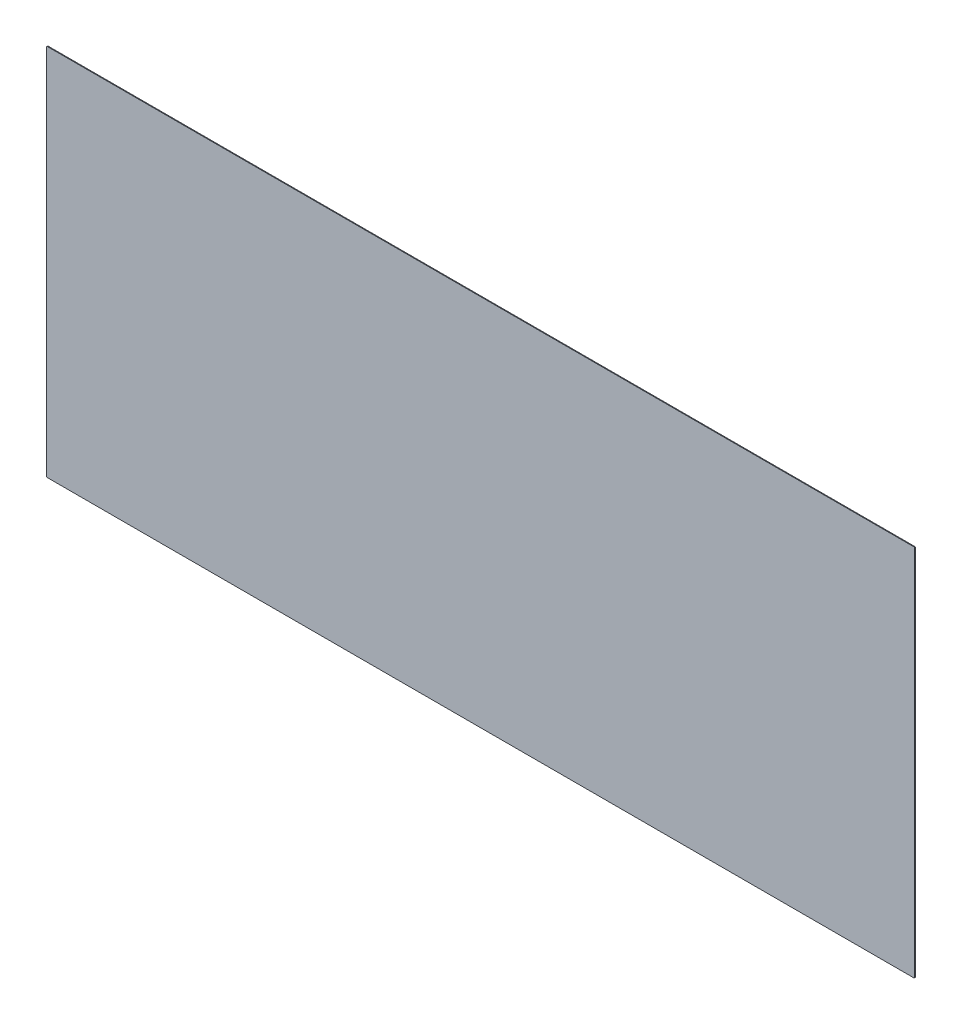
ISO-10303-21;
HEADER;
FILE_DESCRIPTION(('STEP AP214'),'2;1');
FILE_NAME('part.step','',(''),(''),'','','');
FILE_SCHEMA(('AUTOMOTIVE_DESIGN { 1 0 10303 214 1 1 1 1 }'));
ENDSEC;
DATA;
#1=APPLICATION_CONTEXT('core data for automotive mechanical design processes');
#2=APPLICATION_PROTOCOL_DEFINITION('international standard','automotive_design',2000,#1);
#3=PRODUCT_CONTEXT('',#1,'mechanical');
#4=PRODUCT('Part','Part','',(#3));
#5=PRODUCT_RELATED_PRODUCT_CATEGORY('part','',(#4));
#6=PRODUCT_DEFINITION_FORMATION('','',#4);
#7=PRODUCT_DEFINITION_CONTEXT('part definition',#1,'design');
#8=PRODUCT_DEFINITION('design','',#6,#7);
#9=PRODUCT_DEFINITION_SHAPE('','',#8);
#10=(LENGTH_UNIT() NAMED_UNIT(*) SI_UNIT(.MILLI.,.METRE.));
#11=(NAMED_UNIT(*) PLANE_ANGLE_UNIT() SI_UNIT($,.RADIAN.));
#12=(NAMED_UNIT(*) SI_UNIT($,.STERADIAN.) SOLID_ANGLE_UNIT());
#13=UNCERTAINTY_MEASURE_WITH_UNIT(LENGTH_MEASURE(1.E-05),#10,'distance_accuracy_value','');
#14=(GEOMETRIC_REPRESENTATION_CONTEXT(3) GLOBAL_UNCERTAINTY_ASSIGNED_CONTEXT((#13)) GLOBAL_UNIT_ASSIGNED_CONTEXT((#10,
#11,#12)) REPRESENTATION_CONTEXT('',''));
#15=CARTESIAN_POINT('',(0.,0.,0.));
#16=DIRECTION('',(0.,0.,1.));
#17=DIRECTION('',(1.,0.,0.));
#18=AXIS2_PLACEMENT_3D('',#15,#16,#17);
#19=CARTESIAN_POINT('',(1159.,498.,-1.));
#20=DIRECTION('',(0.,0.,1.));
#21=DIRECTION('',(1.,0.,0.));
#22=AXIS2_PLACEMENT_3D('',#19,#20,#21);
#23=CYLINDRICAL_SURFACE('',#22,0.999999999999945);
#24=CARTESIAN_POINT('',(1159.,498.,0.));
#25=DIRECTION('',(0.,0.,1.));
#26=DIRECTION('',(-1.,0.,0.));
#27=AXIS2_PLACEMENT_3D('',#24,#25,#26);
#28=CIRCLE('',#27,0.999999999999945);
#29=CARTESIAN_POINT('',(1160.,498.,0.));
#30=VERTEX_POINT('',#29);
#31=CARTESIAN_POINT('',(1159.,499.,0.));
#32=VERTEX_POINT('',#31);
#33=EDGE_CURVE('E160',#30,#32,#28,.T.);
#34=ORIENTED_EDGE('',*,*,#33,.F.);
#35=DIRECTION('',(0.,0.,1.));
#36=VECTOR('',#35,1.);
#37=CARTESIAN_POINT('',(1160.,498.,-1.));
#38=LINE('',#37,#36);
#39=CARTESIAN_POINT('',(1160.,498.,-1.));
#40=VERTEX_POINT('',#39);
#41=EDGE_CURVE('E12',#40,#30,#38,.T.);
#42=ORIENTED_EDGE('',*,*,#41,.F.);
#43=CARTESIAN_POINT('',(1159.,498.,-1.));
#44=DIRECTION('',(0.,0.,1.));
#45=DIRECTION('',(-1.,0.,0.));
#46=AXIS2_PLACEMENT_3D('',#43,#44,#45);
#47=CIRCLE('',#46,0.999999999999945);
#48=CARTESIAN_POINT('',(1159.,499.,-1.));
#49=VERTEX_POINT('',#48);
#50=EDGE_CURVE('E154',#40,#49,#47,.T.);
#51=ORIENTED_EDGE('',*,*,#50,.T.);
#52=DIRECTION('',(0.,0.,1.));
#53=VECTOR('',#52,1.);
#54=CARTESIAN_POINT('',(1159.,499.,-1.));
#55=LINE('',#54,#53);
#56=EDGE_CURVE('E44',#49,#32,#55,.T.);
#57=ORIENTED_EDGE('',*,*,#56,.T.);
#58=EDGE_LOOP('',(#34,#42,#51,#57));
#59=FACE_BOUND('',#58,.T.);
#60=ADVANCED_FACE('F41',(#59),#23,.T.);
#61=CARTESIAN_POINT('',(1160.,1.00000000000001,-1.));
#62=DIRECTION('',(1.,0.,0.));
#63=DIRECTION('',(0.,0.,-1.));
#64=AXIS2_PLACEMENT_3D('',#61,#62,#63);
#65=PLANE('',#64);
#66=DIRECTION('',(0.,1.,0.));
#67=VECTOR('',#66,1.);
#68=CARTESIAN_POINT('',(1160.,1.00000000000001,0.));
#69=LINE('',#68,#67);
#70=CARTESIAN_POINT('',(1160.,1.,0.));
#71=VERTEX_POINT('',#70);
#72=EDGE_CURVE('E156',#71,#30,#69,.T.);
#73=ORIENTED_EDGE('',*,*,#72,.F.);
#74=DIRECTION('',(0.,0.,1.));
#75=VECTOR('',#74,1.);
#76=CARTESIAN_POINT('',(1160.,1.,-1.));
#77=LINE('',#76,#75);
#78=CARTESIAN_POINT('',(1160.,1.,-1.));
#79=VERTEX_POINT('',#78);
#80=EDGE_CURVE('E50',#79,#71,#77,.T.);
#81=ORIENTED_EDGE('',*,*,#80,.F.);
#82=DIRECTION('',(0.,1.,0.));
#83=VECTOR('',#82,1.);
#84=CARTESIAN_POINT('',(1160.,1.00000000000001,-1.));
#85=LINE('',#84,#83);
#86=EDGE_CURVE('E128',#79,#40,#85,.T.);
#87=ORIENTED_EDGE('',*,*,#86,.T.);
#88=ORIENTED_EDGE('',*,*,#41,.T.);
#89=EDGE_LOOP('',(#73,#81,#87,#88));
#90=FACE_BOUND('',#89,.T.);
#91=ADVANCED_FACE('F190',(#90),#65,.T.);
#92=CARTESIAN_POINT('',(1159.,1.,-1.));
#93=DIRECTION('',(0.,0.,1.));
#94=DIRECTION('',(1.,0.,0.));
#95=AXIS2_PLACEMENT_3D('',#92,#93,#94);
#96=CYLINDRICAL_SURFACE('',#95,0.999999999999945);
#97=CARTESIAN_POINT('',(1159.,1.,0.));
#98=DIRECTION('',(0.,0.,1.));
#99=DIRECTION('',(1.,0.,0.));
#100=AXIS2_PLACEMENT_3D('',#97,#98,#99);
#101=CIRCLE('',#100,0.999999999999945);
#102=CARTESIAN_POINT('',(1159.,0.,0.));
#103=VERTEX_POINT('',#102);
#104=EDGE_CURVE('E115',#103,#71,#101,.T.);
#105=ORIENTED_EDGE('',*,*,#104,.F.);
#106=DIRECTION('',(0.,0.,1.));
#107=VECTOR('',#106,1.);
#108=CARTESIAN_POINT('',(1159.,0.,-1.));
#109=LINE('',#108,#107);
#110=CARTESIAN_POINT('',(1159.,0.,-1.));
#111=VERTEX_POINT('',#110);
#112=EDGE_CURVE('E110',#111,#103,#109,.T.);
#113=ORIENTED_EDGE('',*,*,#112,.F.);
#114=CARTESIAN_POINT('',(1159.,1.,-1.));
#115=DIRECTION('',(0.,0.,1.));
#116=DIRECTION('',(1.,0.,0.));
#117=AXIS2_PLACEMENT_3D('',#114,#115,#116);
#118=CIRCLE('',#117,0.999999999999945);
#119=EDGE_CURVE('E113',#111,#79,#118,.T.);
#120=ORIENTED_EDGE('',*,*,#119,.T.);
#121=ORIENTED_EDGE('',*,*,#80,.T.);
#122=EDGE_LOOP('',(#105,#113,#120,#121));
#123=FACE_BOUND('',#122,.T.);
#124=ADVANCED_FACE('F112',(#123),#96,.T.);
#125=CARTESIAN_POINT('',(1.00000000000001,0.,-1.));
#126=DIRECTION('',(0.,-1.,0.));
#127=DIRECTION('',(0.,0.,-1.));
#128=AXIS2_PLACEMENT_3D('',#125,#126,#127);
#129=PLANE('',#128);
#130=DIRECTION('',(1.,0.,0.));
#131=VECTOR('',#130,1.);
#132=CARTESIAN_POINT('',(1.00000000000001,0.,0.));
#133=LINE('',#132,#131);
#134=CARTESIAN_POINT('',(1.00000000000001,0.,0.));
#135=VERTEX_POINT('',#134);
#136=EDGE_CURVE('E175',#135,#103,#133,.T.);
#137=ORIENTED_EDGE('',*,*,#136,.F.);
#138=DIRECTION('',(0.,0.,1.));
#139=VECTOR('',#138,1.);
#140=CARTESIAN_POINT('',(1.00000000000001,0.,-1.));
#141=LINE('',#140,#139);
#142=CARTESIAN_POINT('',(1.00000000000001,0.,-1.));
#143=VERTEX_POINT('',#142);
#144=EDGE_CURVE('E120',#143,#135,#141,.T.);
#145=ORIENTED_EDGE('',*,*,#144,.F.);
#146=DIRECTION('',(1.,0.,0.));
#147=VECTOR('',#146,1.);
#148=CARTESIAN_POINT('',(1.00000000000001,0.,-1.));
#149=LINE('',#148,#147);
#150=EDGE_CURVE('E126',#143,#111,#149,.T.);
#151=ORIENTED_EDGE('',*,*,#150,.T.);
#152=ORIENTED_EDGE('',*,*,#112,.T.);
#153=EDGE_LOOP('',(#137,#145,#151,#152));
#154=FACE_BOUND('',#153,.T.);
#155=ADVANCED_FACE('F130',(#154),#129,.T.);
#156=CARTESIAN_POINT('',(1.,1.,-1.));
#157=DIRECTION('',(0.,0.,1.));
#158=DIRECTION('',(1.,0.,0.));
#159=AXIS2_PLACEMENT_3D('',#156,#157,#158);
#160=CYLINDRICAL_SURFACE('',#159,1.);
#161=CARTESIAN_POINT('',(1.,1.,0.));
#162=DIRECTION('',(0.,0.,1.));
#163=DIRECTION('',(-1.,0.,0.));
#164=AXIS2_PLACEMENT_3D('',#161,#162,#163);
#165=CIRCLE('',#164,1.);
#166=CARTESIAN_POINT('',(0.,1.00000000000001,0.));
#167=VERTEX_POINT('',#166);
#168=EDGE_CURVE('E172',#167,#135,#165,.T.);
#169=ORIENTED_EDGE('',*,*,#168,.F.);
#170=DIRECTION('',(0.,0.,1.));
#171=VECTOR('',#170,1.);
#172=CARTESIAN_POINT('',(0.,1.00000000000001,-1.));
#173=LINE('',#172,#171);
#174=CARTESIAN_POINT('',(0.,1.00000000000001,-1.));
#175=VERTEX_POINT('',#174);
#176=EDGE_CURVE('E182',#175,#167,#173,.T.);
#177=ORIENTED_EDGE('',*,*,#176,.F.);
#178=CARTESIAN_POINT('',(1.,1.,-1.));
#179=DIRECTION('',(0.,0.,1.));
#180=DIRECTION('',(-1.,0.,0.));
#181=AXIS2_PLACEMENT_3D('',#178,#179,#180);
#182=CIRCLE('',#181,1.);
#183=EDGE_CURVE('E131',#175,#143,#182,.T.);
#184=ORIENTED_EDGE('',*,*,#183,.T.);
#185=ORIENTED_EDGE('',*,*,#144,.T.);
#186=EDGE_LOOP('',(#169,#177,#184,#185));
#187=FACE_BOUND('',#186,.T.);
#188=ADVANCED_FACE('F203',(#187),#160,.T.);
#189=CARTESIAN_POINT('',(0.,1.00000000000001,-1.));
#190=DIRECTION('',(-1.,0.,0.));
#191=DIRECTION('',(0.,0.,1.));
#192=AXIS2_PLACEMENT_3D('',#189,#190,#191);
#193=PLANE('',#192);
#194=DIRECTION('',(0.,-1.,0.));
#195=VECTOR('',#194,1.);
#196=CARTESIAN_POINT('',(0.,1.00000000000001,0.));
#197=LINE('',#196,#195);
#198=CARTESIAN_POINT('',(0.,498.,0.));
#199=VERTEX_POINT('',#198);
#200=EDGE_CURVE('E169',#199,#167,#197,.T.);
#201=ORIENTED_EDGE('',*,*,#200,.F.);
#202=DIRECTION('',(0.,0.,1.));
#203=VECTOR('',#202,1.);
#204=CARTESIAN_POINT('',(0.,498.,-1.));
#205=LINE('',#204,#203);
#206=CARTESIAN_POINT('',(0.,498.,-1.));
#207=VERTEX_POINT('',#206);
#208=EDGE_CURVE('E184',#207,#199,#205,.T.);
#209=ORIENTED_EDGE('',*,*,#208,.F.);
#210=DIRECTION('',(0.,-1.,0.));
#211=VECTOR('',#210,1.);
#212=CARTESIAN_POINT('',(0.,1.00000000000001,-1.));
#213=LINE('',#212,#211);
#214=EDGE_CURVE('E133',#207,#175,#213,.T.);
#215=ORIENTED_EDGE('',*,*,#214,.T.);
#216=ORIENTED_EDGE('',*,*,#176,.T.);
#217=EDGE_LOOP('',(#201,#209,#215,#216));
#218=FACE_BOUND('',#217,.T.);
#219=ADVANCED_FACE('F206',(#218),#193,.T.);
#220=CARTESIAN_POINT('',(1.,498.,-1.));
#221=DIRECTION('',(0.,0.,1.));
#222=DIRECTION('',(1.,0.,0.));
#223=AXIS2_PLACEMENT_3D('',#220,#221,#222);
#224=CYLINDRICAL_SURFACE('',#223,1.);
#225=CARTESIAN_POINT('',(1.,498.,0.));
#226=DIRECTION('',(0.,0.,1.));
#227=DIRECTION('',(-1.,0.,0.));
#228=AXIS2_PLACEMENT_3D('',#225,#226,#227);
#229=CIRCLE('',#228,1.);
#230=CARTESIAN_POINT('',(1.,499.,0.));
#231=VERTEX_POINT('',#230);
#232=EDGE_CURVE('E166',#231,#199,#229,.T.);
#233=ORIENTED_EDGE('',*,*,#232,.F.);
#234=DIRECTION('',(0.,0.,1.));
#235=VECTOR('',#234,1.);
#236=CARTESIAN_POINT('',(1.,499.,-1.));
#237=LINE('',#236,#235);
#238=CARTESIAN_POINT('',(1.,499.,-1.));
#239=VERTEX_POINT('',#238);
#240=EDGE_CURVE('E185',#239,#231,#237,.T.);
#241=ORIENTED_EDGE('',*,*,#240,.F.);
#242=CARTESIAN_POINT('',(1.,498.,-1.));
#243=DIRECTION('',(0.,0.,1.));
#244=DIRECTION('',(-1.,0.,0.));
#245=AXIS2_PLACEMENT_3D('',#242,#243,#244);
#246=CIRCLE('',#245,1.);
#247=EDGE_CURVE('E148',#239,#207,#246,.T.);
#248=ORIENTED_EDGE('',*,*,#247,.T.);
#249=ORIENTED_EDGE('',*,*,#208,.T.);
#250=EDGE_LOOP('',(#233,#241,#248,#249));
#251=FACE_BOUND('',#250,.T.);
#252=ADVANCED_FACE('F210',(#251),#224,.T.);
#253=CARTESIAN_POINT('',(1.,499.,-1.));
#254=DIRECTION('',(0.,1.,0.));
#255=DIRECTION('',(0.,0.,1.));
#256=AXIS2_PLACEMENT_3D('',#253,#254,#255);
#257=PLANE('',#256);
#258=DIRECTION('',(-1.,0.,0.));
#259=VECTOR('',#258,1.);
#260=CARTESIAN_POINT('',(1.,499.,0.));
#261=LINE('',#260,#259);
#262=EDGE_CURVE('E163',#32,#231,#261,.T.);
#263=ORIENTED_EDGE('',*,*,#262,.F.);
#264=ORIENTED_EDGE('',*,*,#56,.F.);
#265=DIRECTION('',(-1.,0.,0.));
#266=VECTOR('',#265,1.);
#267=CARTESIAN_POINT('',(1.,499.,-1.));
#268=LINE('',#267,#266);
#269=EDGE_CURVE('E151',#49,#239,#268,.T.);
#270=ORIENTED_EDGE('',*,*,#269,.T.);
#271=ORIENTED_EDGE('',*,*,#240,.T.);
#272=EDGE_LOOP('',(#263,#264,#270,#271));
#273=FACE_BOUND('',#272,.T.);
#274=ADVANCED_FACE('F187',(#273),#257,.T.);
#275=CARTESIAN_POINT('',(1159.,498.,-1.));
#276=DIRECTION('',(0.,0.,-1.));
#277=DIRECTION('',(-1.,0.,0.));
#278=AXIS2_PLACEMENT_3D('',#275,#276,#277);
#279=PLANE('',#278);
#280=ORIENTED_EDGE('',*,*,#50,.F.);
#281=ORIENTED_EDGE('',*,*,#86,.F.);
#282=ORIENTED_EDGE('',*,*,#119,.F.);
#283=ORIENTED_EDGE('',*,*,#150,.F.);
#284=ORIENTED_EDGE('',*,*,#183,.F.);
#285=ORIENTED_EDGE('',*,*,#214,.F.);
#286=ORIENTED_EDGE('',*,*,#247,.F.);
#287=ORIENTED_EDGE('',*,*,#269,.F.);
#288=EDGE_LOOP('',(#280,#281,#282,#283,#284,#285,#286,#287));
#289=FACE_BOUND('',#288,.T.);
#290=ADVANCED_FACE('F124',(#289),#279,.T.);
#291=CARTESIAN_POINT('',(1159.,498.,0.));
#292=DIRECTION('',(0.,0.,-1.));
#293=DIRECTION('',(-1.,0.,0.));
#294=AXIS2_PLACEMENT_3D('',#291,#292,#293);
#295=PLANE('',#294);
#296=ORIENTED_EDGE('',*,*,#33,.T.);
#297=ORIENTED_EDGE('',*,*,#262,.T.);
#298=ORIENTED_EDGE('',*,*,#232,.T.);
#299=ORIENTED_EDGE('',*,*,#200,.T.);
#300=ORIENTED_EDGE('',*,*,#168,.T.);
#301=ORIENTED_EDGE('',*,*,#136,.T.);
#302=ORIENTED_EDGE('',*,*,#104,.T.);
#303=ORIENTED_EDGE('',*,*,#72,.T.);
#304=EDGE_LOOP('',(#296,#297,#298,#299,#300,#301,#302,#303));
#305=FACE_BOUND('',#304,.T.);
#306=ADVANCED_FACE('F189',(#305),#295,.F.);
#307=CLOSED_SHELL('',(#60,#91,#124,#155,#188,#219,#252,#274,#290,#306));
#308=MANIFOLD_SOLID_BREP('B2',#307);
#309=ADVANCED_BREP_SHAPE_REPRESENTATION('',(#18,#308),#14);
#310=SHAPE_DEFINITION_REPRESENTATION(#9,#309);
ENDSEC;
END-ISO-10303-21;
